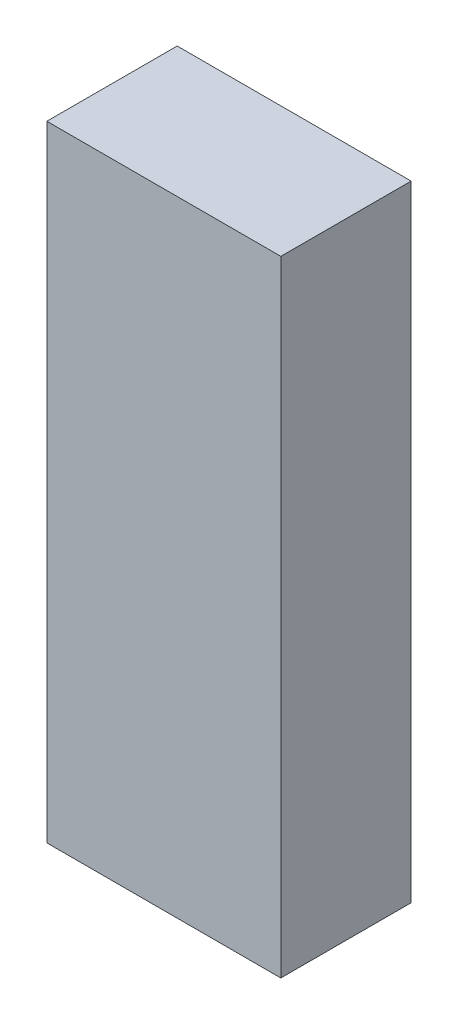
ISO-10303-21;
HEADER;
FILE_DESCRIPTION(('STEP AP214'),'2;1');
FILE_NAME('part.step','',(''),(''),'','','');
FILE_SCHEMA(('AUTOMOTIVE_DESIGN { 1 0 10303 214 1 1 1 1 }'));
ENDSEC;
DATA;
#1=APPLICATION_CONTEXT('core data for automotive mechanical design processes');
#2=APPLICATION_PROTOCOL_DEFINITION('international standard','automotive_design',2000,#1);
#3=PRODUCT_CONTEXT('',#1,'mechanical');
#4=PRODUCT('Part','Part','',(#3));
#5=PRODUCT_RELATED_PRODUCT_CATEGORY('part','',(#4));
#6=PRODUCT_DEFINITION_FORMATION('','',#4);
#7=PRODUCT_DEFINITION_CONTEXT('part definition',#1,'design');
#8=PRODUCT_DEFINITION('design','',#6,#7);
#9=PRODUCT_DEFINITION_SHAPE('','',#8);
#10=(LENGTH_UNIT() NAMED_UNIT(*) SI_UNIT(.MILLI.,.METRE.));
#11=(NAMED_UNIT(*) PLANE_ANGLE_UNIT() SI_UNIT($,.RADIAN.));
#12=(NAMED_UNIT(*) SI_UNIT($,.STERADIAN.) SOLID_ANGLE_UNIT());
#13=UNCERTAINTY_MEASURE_WITH_UNIT(LENGTH_MEASURE(1.E-05),#10,'distance_accuracy_value','');
#14=(GEOMETRIC_REPRESENTATION_CONTEXT(3) GLOBAL_UNCERTAINTY_ASSIGNED_CONTEXT((#13)) GLOBAL_UNIT_ASSIGNED_CONTEXT((#10,
#11,#12)) REPRESENTATION_CONTEXT('',''));
#15=CARTESIAN_POINT('',(0.,0.,0.));
#16=DIRECTION('',(0.,0.,1.));
#17=DIRECTION('',(1.,0.,0.));
#18=AXIS2_PLACEMENT_3D('',#15,#16,#17);
#19=CARTESIAN_POINT('',(114.,304.5,127.));
#20=DIRECTION('',(-1.,0.,0.));
#21=DIRECTION('',(0.,-1.,0.));
#22=AXIS2_PLACEMENT_3D('',#19,#20,#21);
#23=PLANE('',#22);
#24=DIRECTION('',(0.,1.,0.));
#25=VECTOR('',#24,1.);
#26=CARTESIAN_POINT('',(114.,304.5,0.));
#27=LINE('',#26,#25);
#28=CARTESIAN_POINT('',(114.,-304.5,0.));
#29=VERTEX_POINT('',#28);
#30=CARTESIAN_POINT('',(114.,304.5,0.));
#31=VERTEX_POINT('',#30);
#32=EDGE_CURVE('E100',#29,#31,#27,.T.);
#33=ORIENTED_EDGE('',*,*,#32,.T.);
#34=DIRECTION('',(0.,0.,-1.));
#35=VECTOR('',#34,1.);
#36=CARTESIAN_POINT('',(114.,304.5,127.));
#37=LINE('',#36,#35);
#38=CARTESIAN_POINT('',(114.,304.5,127.));
#39=VERTEX_POINT('',#38);
#40=EDGE_CURVE('E11',#39,#31,#37,.T.);
#41=ORIENTED_EDGE('',*,*,#40,.F.);
#42=DIRECTION('',(0.,1.,0.));
#43=VECTOR('',#42,1.);
#44=CARTESIAN_POINT('',(114.,304.5,127.));
#45=LINE('',#44,#43);
#46=CARTESIAN_POINT('',(114.,-304.5,127.));
#47=VERTEX_POINT('',#46);
#48=EDGE_CURVE('E88',#47,#39,#45,.T.);
#49=ORIENTED_EDGE('',*,*,#48,.F.);
#50=DIRECTION('',(0.,0.,-1.));
#51=VECTOR('',#50,1.);
#52=CARTESIAN_POINT('',(114.,-304.5,127.));
#53=LINE('',#52,#51);
#54=EDGE_CURVE('E96',#47,#29,#53,.T.);
#55=ORIENTED_EDGE('',*,*,#54,.T.);
#56=EDGE_LOOP('',(#33,#41,#49,#55));
#57=FACE_BOUND('',#56,.T.);
#58=ADVANCED_FACE('F37',(#57),#23,.F.);
#59=CARTESIAN_POINT('',(-114.,304.5,127.));
#60=DIRECTION('',(0.,-1.,0.));
#61=DIRECTION('',(0.,0.,-1.));
#62=AXIS2_PLACEMENT_3D('',#59,#60,#61);
#63=PLANE('',#62);
#64=DIRECTION('',(-1.,0.,0.));
#65=VECTOR('',#64,1.);
#66=CARTESIAN_POINT('',(-114.,304.5,0.));
#67=LINE('',#66,#65);
#68=CARTESIAN_POINT('',(-114.,304.5,0.));
#69=VERTEX_POINT('',#68);
#70=EDGE_CURVE('E92',#31,#69,#67,.T.);
#71=ORIENTED_EDGE('',*,*,#70,.T.);
#72=DIRECTION('',(0.,0.,-1.));
#73=VECTOR('',#72,1.);
#74=CARTESIAN_POINT('',(-114.,304.5,127.));
#75=LINE('',#74,#73);
#76=CARTESIAN_POINT('',(-114.,304.5,127.));
#77=VERTEX_POINT('',#76);
#78=EDGE_CURVE('E45',#77,#69,#75,.T.);
#79=ORIENTED_EDGE('',*,*,#78,.F.);
#80=DIRECTION('',(-1.,0.,0.));
#81=VECTOR('',#80,1.);
#82=CARTESIAN_POINT('',(-114.,304.5,127.));
#83=LINE('',#82,#81);
#84=EDGE_CURVE('E83',#39,#77,#83,.T.);
#85=ORIENTED_EDGE('',*,*,#84,.F.);
#86=ORIENTED_EDGE('',*,*,#40,.T.);
#87=EDGE_LOOP('',(#71,#79,#85,#86));
#88=FACE_BOUND('',#87,.T.);
#89=ADVANCED_FACE('F91',(#88),#63,.F.);
#90=CARTESIAN_POINT('',(-114.,304.5,127.));
#91=DIRECTION('',(1.,0.,0.));
#92=DIRECTION('',(0.,1.,0.));
#93=AXIS2_PLACEMENT_3D('',#90,#91,#92);
#94=PLANE('',#93);
#95=DIRECTION('',(0.,-1.,0.));
#96=VECTOR('',#95,1.);
#97=CARTESIAN_POINT('',(-114.,304.5,0.));
#98=LINE('',#97,#96);
#99=CARTESIAN_POINT('',(-114.,-304.5,0.));
#100=VERTEX_POINT('',#99);
#101=EDGE_CURVE('E70',#69,#100,#98,.T.);
#102=ORIENTED_EDGE('',*,*,#101,.T.);
#103=DIRECTION('',(0.,0.,-1.));
#104=VECTOR('',#103,1.);
#105=CARTESIAN_POINT('',(-114.,-304.5,127.));
#106=LINE('',#105,#104);
#107=CARTESIAN_POINT('',(-114.,-304.5,127.));
#108=VERTEX_POINT('',#107);
#109=EDGE_CURVE('E93',#108,#100,#106,.T.);
#110=ORIENTED_EDGE('',*,*,#109,.F.);
#111=DIRECTION('',(0.,-1.,0.));
#112=VECTOR('',#111,1.);
#113=CARTESIAN_POINT('',(-114.,304.5,127.));
#114=LINE('',#113,#112);
#115=EDGE_CURVE('E86',#77,#108,#114,.T.);
#116=ORIENTED_EDGE('',*,*,#115,.F.);
#117=ORIENTED_EDGE('',*,*,#78,.T.);
#118=EDGE_LOOP('',(#102,#110,#116,#117));
#119=FACE_BOUND('',#118,.T.);
#120=ADVANCED_FACE('F94',(#119),#94,.F.);
#121=CARTESIAN_POINT('',(-114.,-304.5,127.));
#122=DIRECTION('',(0.,1.,0.));
#123=DIRECTION('',(0.,0.,1.));
#124=AXIS2_PLACEMENT_3D('',#121,#122,#123);
#125=PLANE('',#124);
#126=DIRECTION('',(1.,0.,0.));
#127=VECTOR('',#126,1.);
#128=CARTESIAN_POINT('',(-114.,-304.5,0.));
#129=LINE('',#128,#127);
#130=EDGE_CURVE('E76',#100,#29,#129,.T.);
#131=ORIENTED_EDGE('',*,*,#130,.T.);
#132=ORIENTED_EDGE('',*,*,#54,.F.);
#133=DIRECTION('',(1.,0.,0.));
#134=VECTOR('',#133,1.);
#135=CARTESIAN_POINT('',(-114.,-304.5,127.));
#136=LINE('',#135,#134);
#137=EDGE_CURVE('E53',#108,#47,#136,.T.);
#138=ORIENTED_EDGE('',*,*,#137,.F.);
#139=ORIENTED_EDGE('',*,*,#109,.T.);
#140=EDGE_LOOP('',(#131,#132,#138,#139));
#141=FACE_BOUND('',#140,.T.);
#142=ADVANCED_FACE('F107',(#141),#125,.F.);
#143=CARTESIAN_POINT('',(0.,0.,127.));
#144=DIRECTION('',(0.,0.,1.));
#145=DIRECTION('',(1.,0.,0.));
#146=AXIS2_PLACEMENT_3D('',#143,#144,#145);
#147=PLANE('',#146);
#148=ORIENTED_EDGE('',*,*,#48,.T.);
#149=ORIENTED_EDGE('',*,*,#84,.T.);
#150=ORIENTED_EDGE('',*,*,#115,.T.);
#151=ORIENTED_EDGE('',*,*,#137,.T.);
#152=EDGE_LOOP('',(#148,#149,#150,#151));
#153=FACE_BOUND('',#152,.T.);
#154=ADVANCED_FACE('F84',(#153),#147,.T.);
#155=CARTESIAN_POINT('',(0.,0.,0.));
#156=DIRECTION('',(0.,0.,1.));
#157=DIRECTION('',(1.,0.,0.));
#158=AXIS2_PLACEMENT_3D('',#155,#156,#157);
#159=PLANE('',#158);
#160=ORIENTED_EDGE('',*,*,#32,.F.);
#161=ORIENTED_EDGE('',*,*,#130,.F.);
#162=ORIENTED_EDGE('',*,*,#101,.F.);
#163=ORIENTED_EDGE('',*,*,#70,.F.);
#164=EDGE_LOOP('',(#160,#161,#162,#163));
#165=FACE_BOUND('',#164,.T.);
#166=ADVANCED_FACE('F110',(#165),#159,.F.);
#167=CLOSED_SHELL('',(#58,#89,#120,#142,#154,#166));
#168=MANIFOLD_SOLID_BREP('B2',#167);
#169=ADVANCED_BREP_SHAPE_REPRESENTATION('',(#18,#168),#14);
#170=SHAPE_DEFINITION_REPRESENTATION(#9,#169);
ENDSEC;
END-ISO-10303-21;
